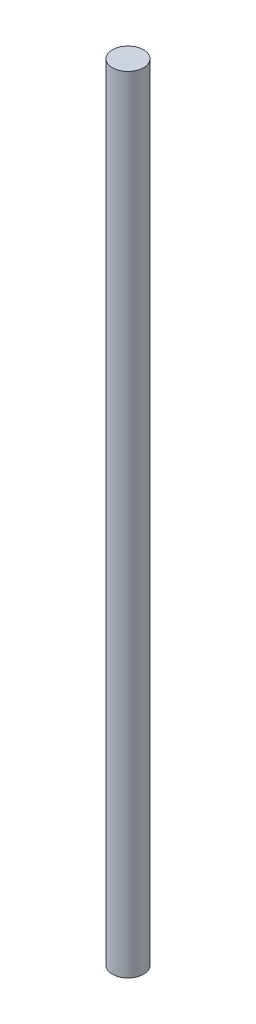
ISO-10303-21;
HEADER;
FILE_DESCRIPTION(('STEP AP214'),'2;1');
FILE_NAME('part.step','',(''),(''),'','','');
FILE_SCHEMA(('AUTOMOTIVE_DESIGN { 1 0 10303 214 1 1 1 1 }'));
ENDSEC;
DATA;
#1=APPLICATION_CONTEXT('core data for automotive mechanical design processes');
#2=APPLICATION_PROTOCOL_DEFINITION('international standard','automotive_design',2000,#1);
#3=PRODUCT_CONTEXT('',#1,'mechanical');
#4=PRODUCT('Part','Part','',(#3));
#5=PRODUCT_RELATED_PRODUCT_CATEGORY('part','',(#4));
#6=PRODUCT_DEFINITION_FORMATION('','',#4);
#7=PRODUCT_DEFINITION_CONTEXT('part definition',#1,'design');
#8=PRODUCT_DEFINITION('design','',#6,#7);
#9=PRODUCT_DEFINITION_SHAPE('','',#8);
#10=(LENGTH_UNIT() NAMED_UNIT(*) SI_UNIT(.MILLI.,.METRE.));
#11=(NAMED_UNIT(*) PLANE_ANGLE_UNIT() SI_UNIT($,.RADIAN.));
#12=(NAMED_UNIT(*) SI_UNIT($,.STERADIAN.) SOLID_ANGLE_UNIT());
#13=UNCERTAINTY_MEASURE_WITH_UNIT(LENGTH_MEASURE(1.E-05),#10,'distance_accuracy_value','');
#14=(GEOMETRIC_REPRESENTATION_CONTEXT(3) GLOBAL_UNCERTAINTY_ASSIGNED_CONTEXT((#13)) GLOBAL_UNIT_ASSIGNED_CONTEXT((#10,
#11,#12)) REPRESENTATION_CONTEXT('',''));
#15=CARTESIAN_POINT('',(0.,0.,0.));
#16=DIRECTION('',(0.,0.,1.));
#17=DIRECTION('',(1.,0.,0.));
#18=AXIS2_PLACEMENT_3D('',#15,#16,#17);
#19=CARTESIAN_POINT('',(0.,100.7125,0.));
#20=DIRECTION('',(0.,-1.,0.));
#21=DIRECTION('',(0.,0.,-1.));
#22=AXIS2_PLACEMENT_3D('',#19,#20,#21);
#23=CYLINDRICAL_SURFACE('',#22,4.);
#24=CARTESIAN_POINT('',(0.,100.7125,0.));
#25=DIRECTION('',(0.,1.,0.));
#26=DIRECTION('',(0.,0.,1.));
#27=AXIS2_PLACEMENT_3D('',#24,#25,#26);
#28=CIRCLE('',#27,4.);
#29=CARTESIAN_POINT('',(0.,100.7125,4.));
#30=VERTEX_POINT('',#29);
#31=EDGE_CURVE('E10',#30,#30,#28,.T.);
#32=ORIENTED_EDGE('',*,*,#31,.F.);
#33=EDGE_LOOP('',(#32));
#34=FACE_BOUND('',#33,.T.);
#35=CARTESIAN_POINT('',(0.,-100.7125,0.));
#36=DIRECTION('',(0.,1.,0.));
#37=DIRECTION('',(0.,0.,1.));
#38=AXIS2_PLACEMENT_3D('',#35,#36,#37);
#39=CIRCLE('',#38,4.);
#40=CARTESIAN_POINT('',(0.,-100.7125,4.));
#41=VERTEX_POINT('',#40);
#42=EDGE_CURVE('E42',#41,#41,#39,.T.);
#43=ORIENTED_EDGE('',*,*,#42,.T.);
#44=EDGE_LOOP('',(#43));
#45=FACE_BOUND('',#44,.T.);
#46=ADVANCED_FACE('F39',(#34,#45),#23,.T.);
#47=CARTESIAN_POINT('',(0.,100.7125,0.));
#48=DIRECTION('',(0.,1.,0.));
#49=DIRECTION('',(0.,0.,1.));
#50=AXIS2_PLACEMENT_3D('',#47,#48,#49);
#51=PLANE('',#50);
#52=ORIENTED_EDGE('',*,*,#31,.T.);
#53=EDGE_LOOP('',(#52));
#54=FACE_BOUND('',#53,.T.);
#55=ADVANCED_FACE('F54',(#54),#51,.T.);
#56=CARTESIAN_POINT('',(0.,-100.7125,0.));
#57=DIRECTION('',(0.,1.,0.));
#58=DIRECTION('',(0.,0.,1.));
#59=AXIS2_PLACEMENT_3D('',#56,#57,#58);
#60=PLANE('',#59);
#61=ORIENTED_EDGE('',*,*,#42,.F.);
#62=EDGE_LOOP('',(#61));
#63=FACE_BOUND('',#62,.T.);
#64=ADVANCED_FACE('F52',(#63),#60,.F.);
#65=CLOSED_SHELL('',(#46,#55,#64));
#66=MANIFOLD_SOLID_BREP('B2',#65);
#67=ADVANCED_BREP_SHAPE_REPRESENTATION('',(#18,#66),#14);
#68=SHAPE_DEFINITION_REPRESENTATION(#9,#67);
ENDSEC;
END-ISO-10303-21;
